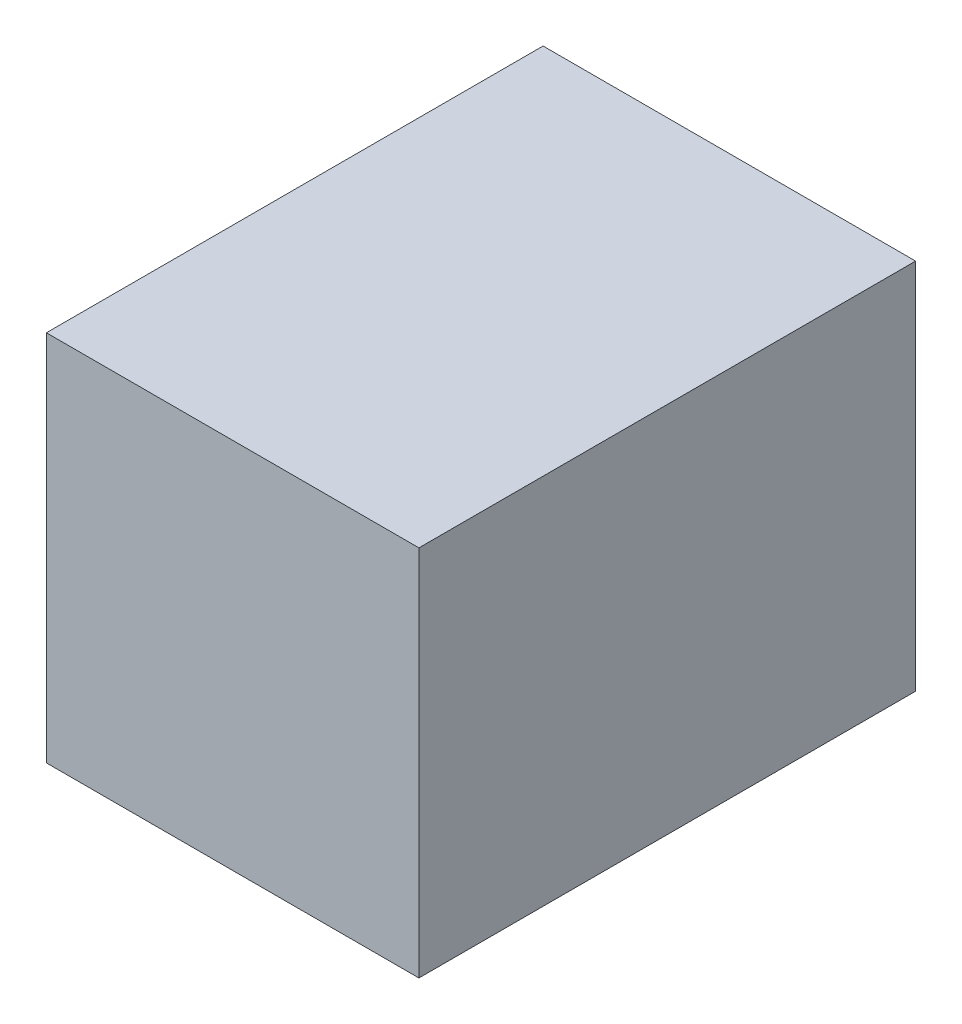
ISO-10303-21;
HEADER;
FILE_DESCRIPTION(('STEP AP214'),'2;1');
FILE_NAME('part.step','',(''),(''),'','','');
FILE_SCHEMA(('AUTOMOTIVE_DESIGN { 1 0 10303 214 1 1 1 1 }'));
ENDSEC;
DATA;
#1=APPLICATION_CONTEXT('core data for automotive mechanical design processes');
#2=APPLICATION_PROTOCOL_DEFINITION('international standard','automotive_design',2000,#1);
#3=PRODUCT_CONTEXT('',#1,'mechanical');
#4=PRODUCT('Part','Part','',(#3));
#5=PRODUCT_RELATED_PRODUCT_CATEGORY('part','',(#4));
#6=PRODUCT_DEFINITION_FORMATION('','',#4);
#7=PRODUCT_DEFINITION_CONTEXT('part definition',#1,'design');
#8=PRODUCT_DEFINITION('design','',#6,#7);
#9=PRODUCT_DEFINITION_SHAPE('','',#8);
#10=(LENGTH_UNIT() NAMED_UNIT(*) SI_UNIT(.MILLI.,.METRE.));
#11=(NAMED_UNIT(*) PLANE_ANGLE_UNIT() SI_UNIT($,.RADIAN.));
#12=(NAMED_UNIT(*) SI_UNIT($,.STERADIAN.) SOLID_ANGLE_UNIT());
#13=UNCERTAINTY_MEASURE_WITH_UNIT(LENGTH_MEASURE(1.E-05),#10,'distance_accuracy_value','');
#14=(GEOMETRIC_REPRESENTATION_CONTEXT(3) GLOBAL_UNCERTAINTY_ASSIGNED_CONTEXT((#13)) GLOBAL_UNIT_ASSIGNED_CONTEXT((#10,
#11,#12)) REPRESENTATION_CONTEXT('',''));
#15=CARTESIAN_POINT('',(0.,0.,0.));
#16=DIRECTION('',(0.,0.,1.));
#17=DIRECTION('',(1.,0.,0.));
#18=AXIS2_PLACEMENT_3D('',#15,#16,#17);
#19=CARTESIAN_POINT('',(0.,0.,0.));
#20=DIRECTION('',(0.,0.,1.));
#21=DIRECTION('',(1.,0.,0.));
#22=AXIS2_PLACEMENT_3D('',#19,#20,#21);
#23=PLANE('',#22);
#24=DIRECTION('',(0.,1.,0.));
#25=VECTOR('',#24,1.);
#26=CARTESIAN_POINT('',(7.5,7.5,0.));
#27=LINE('',#26,#25);
#28=CARTESIAN_POINT('',(7.5,-7.5,0.));
#29=VERTEX_POINT('',#28);
#30=CARTESIAN_POINT('',(7.5,7.5,0.));
#31=VERTEX_POINT('',#30);
#32=EDGE_CURVE('E128',#29,#31,#27,.T.);
#33=ORIENTED_EDGE('',*,*,#32,.F.);
#34=DIRECTION('',(1.,0.,0.));
#35=VECTOR('',#34,1.);
#36=CARTESIAN_POINT('',(-7.5,-7.5,0.));
#37=LINE('',#36,#35);
#38=CARTESIAN_POINT('',(-7.5,-7.5,0.));
#39=VERTEX_POINT('',#38);
#40=EDGE_CURVE('E79',#39,#29,#37,.T.);
#41=ORIENTED_EDGE('',*,*,#40,.F.);
#42=DIRECTION('',(0.,-1.,0.));
#43=VECTOR('',#42,1.);
#44=CARTESIAN_POINT('',(-7.5,7.5,0.));
#45=LINE('',#44,#43);
#46=CARTESIAN_POINT('',(-7.5,7.5,0.));
#47=VERTEX_POINT('',#46);
#48=EDGE_CURVE('E146',#47,#39,#45,.T.);
#49=ORIENTED_EDGE('',*,*,#48,.F.);
#50=DIRECTION('',(-1.,0.,0.));
#51=VECTOR('',#50,1.);
#52=CARTESIAN_POINT('',(-7.5,7.5,0.));
#53=LINE('',#52,#51);
#54=EDGE_CURVE('E132',#31,#47,#53,.T.);
#55=ORIENTED_EDGE('',*,*,#54,.F.);
#56=EDGE_LOOP('',(#33,#41,#49,#55));
#57=FACE_BOUND('',#56,.T.);
#58=DIRECTION('',(0.,1.,0.));
#59=VECTOR('',#58,1.);
#60=CARTESIAN_POINT('',(-6.,0.,0.));
#61=LINE('',#60,#59);
#62=CARTESIAN_POINT('',(-6.,-6.,0.));
#63=VERTEX_POINT('',#62);
#64=CARTESIAN_POINT('',(-6.,6.,0.));
#65=VERTEX_POINT('',#64);
#66=EDGE_CURVE('E11',#63,#65,#61,.T.);
#67=ORIENTED_EDGE('',*,*,#66,.F.);
#68=DIRECTION('',(-1.,0.,0.));
#69=VECTOR('',#68,1.);
#70=CARTESIAN_POINT('',(0.,-6.,0.));
#71=LINE('',#70,#69);
#72=CARTESIAN_POINT('',(6.,-6.,0.));
#73=VERTEX_POINT('',#72);
#74=EDGE_CURVE('E43',#73,#63,#71,.T.);
#75=ORIENTED_EDGE('',*,*,#74,.F.);
#76=DIRECTION('',(0.,-1.,0.));
#77=VECTOR('',#76,1.);
#78=CARTESIAN_POINT('',(6.,0.,0.));
#79=LINE('',#78,#77);
#80=CARTESIAN_POINT('',(6.,6.,0.));
#81=VERTEX_POINT('',#80);
#82=EDGE_CURVE('E159',#81,#73,#79,.T.);
#83=ORIENTED_EDGE('',*,*,#82,.F.);
#84=DIRECTION('',(1.,0.,0.));
#85=VECTOR('',#84,1.);
#86=CARTESIAN_POINT('',(0.,6.,0.));
#87=LINE('',#86,#85);
#88=EDGE_CURVE('E157',#65,#81,#87,.T.);
#89=ORIENTED_EDGE('',*,*,#88,.F.);
#90=EDGE_LOOP('',(#67,#75,#83,#89));
#91=FACE_BOUND('',#90,.T.);
#92=ADVANCED_FACE('F35',(#57,#91),#23,.F.);
#93=CARTESIAN_POINT('',(7.5,7.5,20.));
#94=DIRECTION('',(-1.,0.,0.));
#95=DIRECTION('',(0.,-1.,0.));
#96=AXIS2_PLACEMENT_3D('',#93,#94,#95);
#97=PLANE('',#96);
#98=ORIENTED_EDGE('',*,*,#32,.T.);
#99=DIRECTION('',(0.,0.,-1.));
#100=VECTOR('',#99,1.);
#101=CARTESIAN_POINT('',(7.5,7.5,20.));
#102=LINE('',#101,#100);
#103=CARTESIAN_POINT('',(7.5,7.5,20.));
#104=VERTEX_POINT('',#103);
#105=EDGE_CURVE('E155',#104,#31,#102,.T.);
#106=ORIENTED_EDGE('',*,*,#105,.F.);
#107=DIRECTION('',(0.,1.,0.));
#108=VECTOR('',#107,1.);
#109=CARTESIAN_POINT('',(7.5,7.5,20.));
#110=LINE('',#109,#108);
#111=CARTESIAN_POINT('',(7.5,-7.5,20.));
#112=VERTEX_POINT('',#111);
#113=EDGE_CURVE('E138',#112,#104,#110,.T.);
#114=ORIENTED_EDGE('',*,*,#113,.F.);
#115=DIRECTION('',(0.,0.,-1.));
#116=VECTOR('',#115,1.);
#117=CARTESIAN_POINT('',(7.5,-7.5,20.));
#118=LINE('',#117,#116);
#119=EDGE_CURVE('E143',#112,#29,#118,.T.);
#120=ORIENTED_EDGE('',*,*,#119,.T.);
#121=EDGE_LOOP('',(#98,#106,#114,#120));
#122=FACE_BOUND('',#121,.T.);
#123=ADVANCED_FACE('F37',(#122),#97,.F.);
#124=CARTESIAN_POINT('',(-7.5,7.5,20.));
#125=DIRECTION('',(0.,-1.,0.));
#126=DIRECTION('',(0.,0.,-1.));
#127=AXIS2_PLACEMENT_3D('',#124,#125,#126);
#128=PLANE('',#127);
#129=ORIENTED_EDGE('',*,*,#54,.T.);
#130=DIRECTION('',(0.,0.,-1.));
#131=VECTOR('',#130,1.);
#132=CARTESIAN_POINT('',(-7.5,7.5,20.));
#133=LINE('',#132,#131);
#134=CARTESIAN_POINT('',(-7.5,7.5,20.));
#135=VERTEX_POINT('',#134);
#136=EDGE_CURVE('E152',#135,#47,#133,.T.);
#137=ORIENTED_EDGE('',*,*,#136,.F.);
#138=DIRECTION('',(-1.,0.,0.));
#139=VECTOR('',#138,1.);
#140=CARTESIAN_POINT('',(-7.5,7.5,20.));
#141=LINE('',#140,#139);
#142=EDGE_CURVE('E87',#104,#135,#141,.T.);
#143=ORIENTED_EDGE('',*,*,#142,.F.);
#144=ORIENTED_EDGE('',*,*,#105,.T.);
#145=EDGE_LOOP('',(#129,#137,#143,#144));
#146=FACE_BOUND('',#145,.T.);
#147=ADVANCED_FACE('F186',(#146),#128,.F.);
#148=CARTESIAN_POINT('',(-7.5,7.5,20.));
#149=DIRECTION('',(1.,0.,0.));
#150=DIRECTION('',(0.,1.,0.));
#151=AXIS2_PLACEMENT_3D('',#148,#149,#150);
#152=PLANE('',#151);
#153=ORIENTED_EDGE('',*,*,#48,.T.);
#154=DIRECTION('',(0.,0.,-1.));
#155=VECTOR('',#154,1.);
#156=CARTESIAN_POINT('',(-7.5,-7.5,20.));
#157=LINE('',#156,#155);
#158=CARTESIAN_POINT('',(-7.5,-7.5,20.));
#159=VERTEX_POINT('',#158);
#160=EDGE_CURVE('E150',#159,#39,#157,.T.);
#161=ORIENTED_EDGE('',*,*,#160,.F.);
#162=DIRECTION('',(0.,-1.,0.));
#163=VECTOR('',#162,1.);
#164=CARTESIAN_POINT('',(-7.5,7.5,20.));
#165=LINE('',#164,#163);
#166=EDGE_CURVE('E141',#135,#159,#165,.T.);
#167=ORIENTED_EDGE('',*,*,#166,.F.);
#168=ORIENTED_EDGE('',*,*,#136,.T.);
#169=EDGE_LOOP('',(#153,#161,#167,#168));
#170=FACE_BOUND('',#169,.T.);
#171=ADVANCED_FACE('F196',(#170),#152,.F.);
#172=CARTESIAN_POINT('',(-7.5,-7.5,20.));
#173=DIRECTION('',(0.,1.,0.));
#174=DIRECTION('',(0.,0.,1.));
#175=AXIS2_PLACEMENT_3D('',#172,#173,#174);
#176=PLANE('',#175);
#177=ORIENTED_EDGE('',*,*,#40,.T.);
#178=ORIENTED_EDGE('',*,*,#119,.F.);
#179=DIRECTION('',(1.,0.,0.));
#180=VECTOR('',#179,1.);
#181=CARTESIAN_POINT('',(-7.5,-7.5,20.));
#182=LINE('',#181,#180);
#183=EDGE_CURVE('E58',#159,#112,#182,.T.);
#184=ORIENTED_EDGE('',*,*,#183,.F.);
#185=ORIENTED_EDGE('',*,*,#160,.T.);
#186=EDGE_LOOP('',(#177,#178,#184,#185));
#187=FACE_BOUND('',#186,.T.);
#188=ADVANCED_FACE('F193',(#187),#176,.F.);
#189=CARTESIAN_POINT('',(0.,0.,20.));
#190=DIRECTION('',(0.,0.,1.));
#191=DIRECTION('',(1.,0.,0.));
#192=AXIS2_PLACEMENT_3D('',#189,#190,#191);
#193=PLANE('',#192);
#194=ORIENTED_EDGE('',*,*,#113,.T.);
#195=ORIENTED_EDGE('',*,*,#142,.T.);
#196=ORIENTED_EDGE('',*,*,#166,.T.);
#197=ORIENTED_EDGE('',*,*,#183,.T.);
#198=EDGE_LOOP('',(#194,#195,#196,#197));
#199=FACE_BOUND('',#198,.T.);
#200=ADVANCED_FACE('F191',(#199),#193,.T.);
#201=CARTESIAN_POINT('',(-6.,6.,17.));
#202=DIRECTION('',(1.,0.,0.));
#203=DIRECTION('',(0.,1.,0.));
#204=AXIS2_PLACEMENT_3D('',#201,#202,#203);
#205=PLANE('',#204);
#206=ORIENTED_EDGE('',*,*,#66,.T.);
#207=DIRECTION('',(0.,0.,-1.));
#208=VECTOR('',#207,1.);
#209=CARTESIAN_POINT('',(-6.,6.,17.));
#210=LINE('',#209,#208);
#211=CARTESIAN_POINT('',(-6.,6.,17.));
#212=VERTEX_POINT('',#211);
#213=EDGE_CURVE('E50',#212,#65,#210,.T.);
#214=ORIENTED_EDGE('',*,*,#213,.F.);
#215=DIRECTION('',(0.,-1.,0.));
#216=VECTOR('',#215,1.);
#217=CARTESIAN_POINT('',(-6.,6.,17.));
#218=LINE('',#217,#216);
#219=CARTESIAN_POINT('',(-6.,-6.,17.));
#220=VERTEX_POINT('',#219);
#221=EDGE_CURVE('E113',#212,#220,#218,.T.);
#222=ORIENTED_EDGE('',*,*,#221,.T.);
#223=DIRECTION('',(0.,0.,-1.));
#224=VECTOR('',#223,1.);
#225=CARTESIAN_POINT('',(-6.,-6.,17.));
#226=LINE('',#225,#224);
#227=EDGE_CURVE('E123',#220,#63,#226,.T.);
#228=ORIENTED_EDGE('',*,*,#227,.T.);
#229=EDGE_LOOP('',(#206,#214,#222,#228));
#230=FACE_BOUND('',#229,.T.);
#231=ADVANCED_FACE('F122',(#230),#205,.T.);
#232=CARTESIAN_POINT('',(6.,-6.,17.));
#233=DIRECTION('',(0.,1.,0.));
#234=DIRECTION('',(-1.,0.,0.));
#235=AXIS2_PLACEMENT_3D('',#232,#233,#234);
#236=PLANE('',#235);
#237=ORIENTED_EDGE('',*,*,#74,.T.);
#238=ORIENTED_EDGE('',*,*,#227,.F.);
#239=DIRECTION('',(1.,0.,0.));
#240=VECTOR('',#239,1.);
#241=CARTESIAN_POINT('',(6.,-6.,17.));
#242=LINE('',#241,#240);
#243=CARTESIAN_POINT('',(6.,-6.,17.));
#244=VERTEX_POINT('',#243);
#245=EDGE_CURVE('E109',#220,#244,#242,.T.);
#246=ORIENTED_EDGE('',*,*,#245,.T.);
#247=DIRECTION('',(0.,0.,-1.));
#248=VECTOR('',#247,1.);
#249=CARTESIAN_POINT('',(6.,-6.,17.));
#250=LINE('',#249,#248);
#251=EDGE_CURVE('E129',#244,#73,#250,.T.);
#252=ORIENTED_EDGE('',*,*,#251,.T.);
#253=EDGE_LOOP('',(#237,#238,#246,#252));
#254=FACE_BOUND('',#253,.T.);
#255=ADVANCED_FACE('F126',(#254),#236,.T.);
#256=CARTESIAN_POINT('',(6.,6.,17.));
#257=DIRECTION('',(-1.,0.,0.));
#258=DIRECTION('',(0.,-1.,0.));
#259=AXIS2_PLACEMENT_3D('',#256,#257,#258);
#260=PLANE('',#259);
#261=ORIENTED_EDGE('',*,*,#82,.T.);
#262=ORIENTED_EDGE('',*,*,#251,.F.);
#263=DIRECTION('',(0.,1.,0.));
#264=VECTOR('',#263,1.);
#265=CARTESIAN_POINT('',(6.,6.,17.));
#266=LINE('',#265,#264);
#267=CARTESIAN_POINT('',(6.,6.,17.));
#268=VERTEX_POINT('',#267);
#269=EDGE_CURVE('E114',#244,#268,#266,.T.);
#270=ORIENTED_EDGE('',*,*,#269,.T.);
#271=DIRECTION('',(0.,0.,-1.));
#272=VECTOR('',#271,1.);
#273=CARTESIAN_POINT('',(6.,6.,17.));
#274=LINE('',#273,#272);
#275=EDGE_CURVE('E134',#268,#81,#274,.T.);
#276=ORIENTED_EDGE('',*,*,#275,.T.);
#277=EDGE_LOOP('',(#261,#262,#270,#276));
#278=FACE_BOUND('',#277,.T.);
#279=ADVANCED_FACE('F163',(#278),#260,.T.);
#280=CARTESIAN_POINT('',(6.,6.,17.));
#281=DIRECTION('',(0.,-1.,0.));
#282=DIRECTION('',(1.,0.,0.));
#283=AXIS2_PLACEMENT_3D('',#280,#281,#282);
#284=PLANE('',#283);
#285=ORIENTED_EDGE('',*,*,#88,.T.);
#286=ORIENTED_EDGE('',*,*,#275,.F.);
#287=DIRECTION('',(-1.,0.,0.));
#288=VECTOR('',#287,1.);
#289=CARTESIAN_POINT('',(6.,6.,17.));
#290=LINE('',#289,#288);
#291=EDGE_CURVE('E168',#268,#212,#290,.T.);
#292=ORIENTED_EDGE('',*,*,#291,.T.);
#293=ORIENTED_EDGE('',*,*,#213,.T.);
#294=EDGE_LOOP('',(#285,#286,#292,#293));
#295=FACE_BOUND('',#294,.T.);
#296=ADVANCED_FACE('F167',(#295),#284,.T.);
#297=CARTESIAN_POINT('',(0.,0.,17.));
#298=DIRECTION('',(0.,0.,-1.));
#299=DIRECTION('',(-1.,0.,0.));
#300=AXIS2_PLACEMENT_3D('',#297,#298,#299);
#301=PLANE('',#300);
#302=ORIENTED_EDGE('',*,*,#221,.F.);
#303=ORIENTED_EDGE('',*,*,#291,.F.);
#304=ORIENTED_EDGE('',*,*,#269,.F.);
#305=ORIENTED_EDGE('',*,*,#245,.F.);
#306=EDGE_LOOP('',(#302,#303,#304,#305));
#307=FACE_BOUND('',#306,.T.);
#308=ADVANCED_FACE('F111',(#307),#301,.T.);
#309=CLOSED_SHELL('',(#92,#123,#147,#171,#188,#200,#231,#255,#279,#296,#308));
#310=MANIFOLD_SOLID_BREP('B2',#309);
#311=ADVANCED_BREP_SHAPE_REPRESENTATION('',(#18,#310),#14);
#312=SHAPE_DEFINITION_REPRESENTATION(#9,#311);
ENDSEC;
END-ISO-10303-21;
